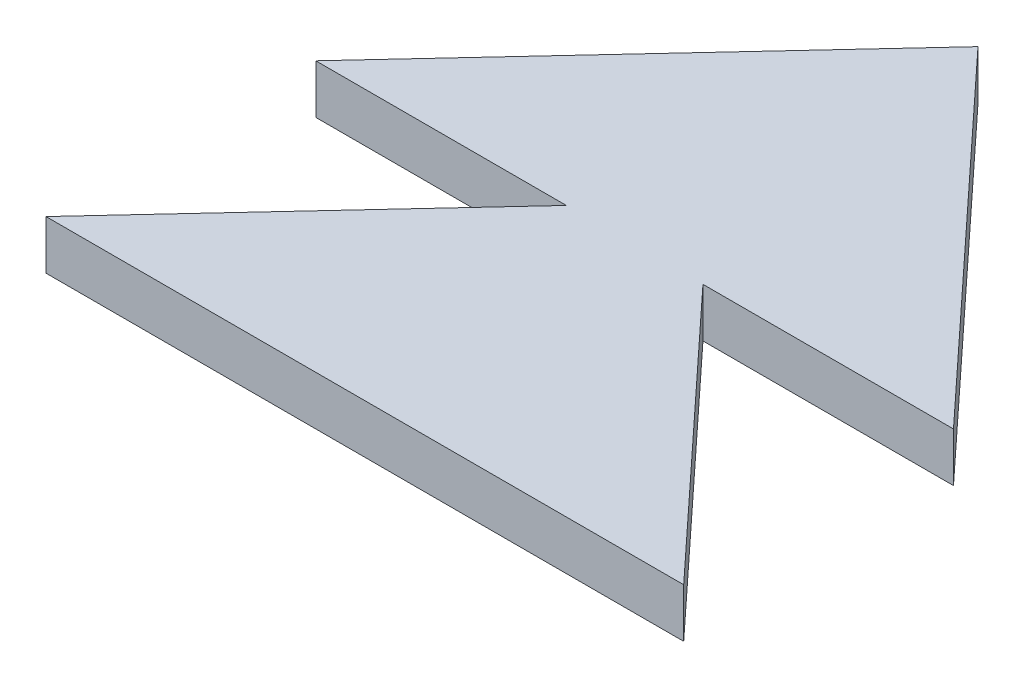
ISO-10303-21;
HEADER;
FILE_DESCRIPTION(('STEP AP214'),'2;1');
FILE_NAME('part.step','',(''),(''),'','','');
FILE_SCHEMA(('AUTOMOTIVE_DESIGN { 1 0 10303 214 1 1 1 1 }'));
ENDSEC;
DATA;
#1=APPLICATION_CONTEXT('core data for automotive mechanical design processes');
#2=APPLICATION_PROTOCOL_DEFINITION('international standard','automotive_design',2000,#1);
#3=PRODUCT_CONTEXT('',#1,'mechanical');
#4=PRODUCT('Part','Part','',(#3));
#5=PRODUCT_RELATED_PRODUCT_CATEGORY('part','',(#4));
#6=PRODUCT_DEFINITION_FORMATION('','',#4);
#7=PRODUCT_DEFINITION_CONTEXT('part definition',#1,'design');
#8=PRODUCT_DEFINITION('design','',#6,#7);
#9=PRODUCT_DEFINITION_SHAPE('','',#8);
#10=(LENGTH_UNIT() NAMED_UNIT(*) SI_UNIT(.MILLI.,.METRE.));
#11=(NAMED_UNIT(*) PLANE_ANGLE_UNIT() SI_UNIT($,.RADIAN.));
#12=(NAMED_UNIT(*) SI_UNIT($,.STERADIAN.) SOLID_ANGLE_UNIT());
#13=UNCERTAINTY_MEASURE_WITH_UNIT(LENGTH_MEASURE(1.E-05),#10,'distance_accuracy_value','');
#14=(GEOMETRIC_REPRESENTATION_CONTEXT(3) GLOBAL_UNCERTAINTY_ASSIGNED_CONTEXT((#13)) GLOBAL_UNIT_ASSIGNED_CONTEXT((#10,
#11,#12)) REPRESENTATION_CONTEXT('',''));
#15=CARTESIAN_POINT('',(0.,0.,0.));
#16=DIRECTION('',(0.,0.,1.));
#17=DIRECTION('',(1.,0.,0.));
#18=AXIS2_PLACEMENT_3D('',#15,#16,#17);
#19=CARTESIAN_POINT('',(5.10714285714286,1.,-5.5));
#20=DIRECTION('',(0.732793491626299,0.,0.680451099367278));
#21=DIRECTION('',(0.680451099367278,0.,-0.732793491626299));
#22=AXIS2_PLACEMENT_3D('',#19,#20,#21);
#23=PLANE('',#22);
#24=DIRECTION('',(-0.680451099367278,0.,0.732793491626299));
#25=VECTOR('',#24,1.);
#26=CARTESIAN_POINT('',(5.10714285714286,0.,-5.5));
#27=LINE('',#26,#25);
#28=CARTESIAN_POINT('',(5.10714285714286,0.,-5.5));
#29=VERTEX_POINT('',#28);
#30=CARTESIAN_POINT('',(0.,0.,0.));
#31=VERTEX_POINT('',#30);
#32=EDGE_CURVE('E129',#29,#31,#27,.T.);
#33=ORIENTED_EDGE('',*,*,#32,.T.);
#34=DIRECTION('',(0.,-1.,0.));
#35=VECTOR('',#34,1.);
#36=CARTESIAN_POINT('',(0.,1.,0.));
#37=LINE('',#36,#35);
#38=CARTESIAN_POINT('',(0.,1.,0.));
#39=VERTEX_POINT('',#38);
#40=EDGE_CURVE('E11',#39,#31,#37,.T.);
#41=ORIENTED_EDGE('',*,*,#40,.F.);
#42=DIRECTION('',(-0.680451099367278,0.,0.732793491626299));
#43=VECTOR('',#42,1.);
#44=CARTESIAN_POINT('',(5.10714285714286,1.,-5.5));
#45=LINE('',#44,#43);
#46=CARTESIAN_POINT('',(5.10714285714286,1.,-5.5));
#47=VERTEX_POINT('',#46);
#48=EDGE_CURVE('E141',#47,#39,#45,.T.);
#49=ORIENTED_EDGE('',*,*,#48,.F.);
#50=DIRECTION('',(0.,-1.,0.));
#51=VECTOR('',#50,1.);
#52=CARTESIAN_POINT('',(5.10714285714286,1.,-5.5));
#53=LINE('',#52,#51);
#54=EDGE_CURVE('E125',#47,#29,#53,.T.);
#55=ORIENTED_EDGE('',*,*,#54,.T.);
#56=EDGE_LOOP('',(#33,#41,#49,#55));
#57=FACE_BOUND('',#56,.T.);
#58=ADVANCED_FACE('F39',(#57),#23,.F.);
#59=CARTESIAN_POINT('',(0.,1.,0.));
#60=DIRECTION('',(0.,0.,-1.));
#61=DIRECTION('',(-1.,0.,0.));
#62=AXIS2_PLACEMENT_3D('',#59,#60,#61);
#63=PLANE('',#62);
#64=DIRECTION('',(1.,0.,0.));
#65=VECTOR('',#64,1.);
#66=CARTESIAN_POINT('',(0.,0.,0.));
#67=LINE('',#66,#65);
#68=CARTESIAN_POINT('',(13.,0.,0.));
#69=VERTEX_POINT('',#68);
#70=EDGE_CURVE('E132',#31,#69,#67,.T.);
#71=ORIENTED_EDGE('',*,*,#70,.T.);
#72=DIRECTION('',(0.,-1.,0.));
#73=VECTOR('',#72,1.);
#74=CARTESIAN_POINT('',(13.,1.,0.));
#75=LINE('',#74,#73);
#76=CARTESIAN_POINT('',(13.,1.,0.));
#77=VERTEX_POINT('',#76);
#78=EDGE_CURVE('E47',#77,#69,#75,.T.);
#79=ORIENTED_EDGE('',*,*,#78,.F.);
#80=DIRECTION('',(1.,0.,0.));
#81=VECTOR('',#80,1.);
#82=CARTESIAN_POINT('',(0.,1.,0.));
#83=LINE('',#82,#81);
#84=EDGE_CURVE('E95',#39,#77,#83,.T.);
#85=ORIENTED_EDGE('',*,*,#84,.F.);
#86=ORIENTED_EDGE('',*,*,#40,.T.);
#87=EDGE_LOOP('',(#71,#79,#85,#86));
#88=FACE_BOUND('',#87,.T.);
#89=ADVANCED_FACE('F166',(#88),#63,.F.);
#90=CARTESIAN_POINT('',(13.,1.,0.));
#91=DIRECTION('',(-0.732793491626299,0.,0.680451099367278));
#92=DIRECTION('',(0.680451099367278,0.,0.732793491626299));
#93=AXIS2_PLACEMENT_3D('',#90,#91,#92);
#94=PLANE('',#93);
#95=DIRECTION('',(-0.680451099367278,0.,-0.732793491626299));
#96=VECTOR('',#95,1.);
#97=CARTESIAN_POINT('',(13.,0.,0.));
#98=LINE('',#97,#96);
#99=CARTESIAN_POINT('',(7.89285714285714,0.,-5.5));
#100=VERTEX_POINT('',#99);
#101=EDGE_CURVE('E134',#69,#100,#98,.T.);
#102=ORIENTED_EDGE('',*,*,#101,.T.);
#103=DIRECTION('',(0.,-1.,0.));
#104=VECTOR('',#103,1.);
#105=CARTESIAN_POINT('',(7.89285714285714,1.,-5.5));
#106=LINE('',#105,#104);
#107=CARTESIAN_POINT('',(7.89285714285714,1.,-5.5));
#108=VERTEX_POINT('',#107);
#109=EDGE_CURVE('E145',#108,#100,#106,.T.);
#110=ORIENTED_EDGE('',*,*,#109,.F.);
#111=DIRECTION('',(-0.680451099367278,0.,-0.732793491626299));
#112=VECTOR('',#111,1.);
#113=CARTESIAN_POINT('',(13.,1.,0.));
#114=LINE('',#113,#112);
#115=EDGE_CURVE('E153',#77,#108,#114,.T.);
#116=ORIENTED_EDGE('',*,*,#115,.F.);
#117=ORIENTED_EDGE('',*,*,#78,.T.);
#118=EDGE_LOOP('',(#102,#110,#116,#117));
#119=FACE_BOUND('',#118,.T.);
#120=ADVANCED_FACE('F151',(#119),#94,.F.);
#121=CARTESIAN_POINT('',(7.89285714285714,1.,-5.5));
#122=DIRECTION('',(0.,0.,-1.));
#123=DIRECTION('',(-1.,0.,0.));
#124=AXIS2_PLACEMENT_3D('',#121,#122,#123);
#125=PLANE('',#124);
#126=DIRECTION('',(1.,0.,0.));
#127=VECTOR('',#126,1.);
#128=CARTESIAN_POINT('',(7.89285714285714,0.,-5.5));
#129=LINE('',#128,#127);
#130=CARTESIAN_POINT('',(13.,0.,-5.5));
#131=VERTEX_POINT('',#130);
#132=EDGE_CURVE('E136',#100,#131,#129,.T.);
#133=ORIENTED_EDGE('',*,*,#132,.T.);
#134=DIRECTION('',(0.,-1.,0.));
#135=VECTOR('',#134,1.);
#136=CARTESIAN_POINT('',(13.,1.,-5.5));
#137=LINE('',#136,#135);
#138=CARTESIAN_POINT('',(13.,1.,-5.5));
#139=VERTEX_POINT('',#138);
#140=EDGE_CURVE('E120',#139,#131,#137,.T.);
#141=ORIENTED_EDGE('',*,*,#140,.F.);
#142=DIRECTION('',(1.,0.,0.));
#143=VECTOR('',#142,1.);
#144=CARTESIAN_POINT('',(7.89285714285714,1.,-5.5));
#145=LINE('',#144,#143);
#146=EDGE_CURVE('E111',#108,#139,#145,.T.);
#147=ORIENTED_EDGE('',*,*,#146,.F.);
#148=ORIENTED_EDGE('',*,*,#109,.T.);
#149=EDGE_LOOP('',(#133,#141,#147,#148));
#150=FACE_BOUND('',#149,.T.);
#151=ADVANCED_FACE('F159',(#150),#125,.F.);
#152=CARTESIAN_POINT('',(13.,1.,-5.5));
#153=DIRECTION('',(-0.732793491626298,0.,0.680451099367279));
#154=DIRECTION('',(0.680451099367279,0.,0.732793491626298));
#155=AXIS2_PLACEMENT_3D('',#152,#153,#154);
#156=PLANE('',#155);
#157=DIRECTION('',(-0.680451099367279,0.,-0.732793491626298));
#158=VECTOR('',#157,1.);
#159=CARTESIAN_POINT('',(13.,0.,-5.5));
#160=LINE('',#159,#158);
#161=CARTESIAN_POINT('',(6.49999999999998,0.,-12.5));
#162=VERTEX_POINT('',#161);
#163=EDGE_CURVE('E119',#131,#162,#160,.T.);
#164=ORIENTED_EDGE('',*,*,#163,.T.);
#165=DIRECTION('',(0.,-1.,0.));
#166=VECTOR('',#165,1.);
#167=CARTESIAN_POINT('',(6.49999999999998,1.,-12.5));
#168=LINE('',#167,#166);
#169=CARTESIAN_POINT('',(6.49999999999998,1.,-12.5));
#170=VERTEX_POINT('',#169);
#171=EDGE_CURVE('E116',#170,#162,#168,.T.);
#172=ORIENTED_EDGE('',*,*,#171,.F.);
#173=DIRECTION('',(-0.680451099367279,0.,-0.732793491626298));
#174=VECTOR('',#173,1.);
#175=CARTESIAN_POINT('',(13.,1.,-5.5));
#176=LINE('',#175,#174);
#177=EDGE_CURVE('E105',#139,#170,#176,.T.);
#178=ORIENTED_EDGE('',*,*,#177,.F.);
#179=ORIENTED_EDGE('',*,*,#140,.T.);
#180=EDGE_LOOP('',(#164,#172,#178,#179));
#181=FACE_BOUND('',#180,.T.);
#182=ADVANCED_FACE('F117',(#181),#156,.F.);
#183=CARTESIAN_POINT('',(6.49999999999998,1.,-12.5));
#184=DIRECTION('',(0.7327934916263,0.,0.680451099367277));
#185=DIRECTION('',(0.680451099367277,0.,-0.7327934916263));
#186=AXIS2_PLACEMENT_3D('',#183,#184,#185);
#187=PLANE('',#186);
#188=DIRECTION('',(-0.680451099367277,0.,0.7327934916263));
#189=VECTOR('',#188,1.);
#190=CARTESIAN_POINT('',(6.49999999999998,0.,-12.5));
#191=LINE('',#190,#189);
#192=CARTESIAN_POINT('',(0.,0.,-5.5));
#193=VERTEX_POINT('',#192);
#194=EDGE_CURVE('E81',#162,#193,#191,.T.);
#195=ORIENTED_EDGE('',*,*,#194,.T.);
#196=DIRECTION('',(0.,-1.,0.));
#197=VECTOR('',#196,1.);
#198=CARTESIAN_POINT('',(0.,1.,-5.5));
#199=LINE('',#198,#197);
#200=CARTESIAN_POINT('',(0.,1.,-5.5));
#201=VERTEX_POINT('',#200);
#202=EDGE_CURVE('E121',#201,#193,#199,.T.);
#203=ORIENTED_EDGE('',*,*,#202,.F.);
#204=DIRECTION('',(-0.680451099367277,0.,0.7327934916263));
#205=VECTOR('',#204,1.);
#206=CARTESIAN_POINT('',(6.49999999999998,1.,-12.5));
#207=LINE('',#206,#205);
#208=EDGE_CURVE('E109',#170,#201,#207,.T.);
#209=ORIENTED_EDGE('',*,*,#208,.F.);
#210=ORIENTED_EDGE('',*,*,#171,.T.);
#211=EDGE_LOOP('',(#195,#203,#209,#210));
#212=FACE_BOUND('',#211,.T.);
#213=ADVANCED_FACE('F123',(#212),#187,.F.);
#214=CARTESIAN_POINT('',(0.,1.,-5.5));
#215=DIRECTION('',(0.,0.,-1.));
#216=DIRECTION('',(-1.,0.,0.));
#217=AXIS2_PLACEMENT_3D('',#214,#215,#216);
#218=PLANE('',#217);
#219=DIRECTION('',(1.,0.,0.));
#220=VECTOR('',#219,1.);
#221=CARTESIAN_POINT('',(0.,0.,-5.5));
#222=LINE('',#221,#220);
#223=EDGE_CURVE('E87',#193,#29,#222,.T.);
#224=ORIENTED_EDGE('',*,*,#223,.T.);
#225=ORIENTED_EDGE('',*,*,#54,.F.);
#226=DIRECTION('',(1.,0.,0.));
#227=VECTOR('',#226,1.);
#228=CARTESIAN_POINT('',(0.,1.,-5.5));
#229=LINE('',#228,#227);
#230=EDGE_CURVE('E55',#201,#47,#229,.T.);
#231=ORIENTED_EDGE('',*,*,#230,.F.);
#232=ORIENTED_EDGE('',*,*,#202,.T.);
#233=EDGE_LOOP('',(#224,#225,#231,#232));
#234=FACE_BOUND('',#233,.T.);
#235=ADVANCED_FACE('F180',(#234),#218,.F.);
#236=CARTESIAN_POINT('',(0.,1.,0.));
#237=DIRECTION('',(0.,-1.,0.));
#238=DIRECTION('',(0.,0.,-1.));
#239=AXIS2_PLACEMENT_3D('',#236,#237,#238);
#240=PLANE('',#239);
#241=ORIENTED_EDGE('',*,*,#48,.T.);
#242=ORIENTED_EDGE('',*,*,#84,.T.);
#243=ORIENTED_EDGE('',*,*,#115,.T.);
#244=ORIENTED_EDGE('',*,*,#146,.T.);
#245=ORIENTED_EDGE('',*,*,#177,.T.);
#246=ORIENTED_EDGE('',*,*,#208,.T.);
#247=ORIENTED_EDGE('',*,*,#230,.T.);
#248=EDGE_LOOP('',(#241,#242,#243,#244,#245,#246,#247));
#249=FACE_BOUND('',#248,.T.);
#250=ADVANCED_FACE('F107',(#249),#240,.F.);
#251=CARTESIAN_POINT('',(0.,0.,0.));
#252=DIRECTION('',(0.,-1.,0.));
#253=DIRECTION('',(0.,0.,-1.));
#254=AXIS2_PLACEMENT_3D('',#251,#252,#253);
#255=PLANE('',#254);
#256=ORIENTED_EDGE('',*,*,#32,.F.);
#257=ORIENTED_EDGE('',*,*,#223,.F.);
#258=ORIENTED_EDGE('',*,*,#194,.F.);
#259=ORIENTED_EDGE('',*,*,#163,.F.);
#260=ORIENTED_EDGE('',*,*,#132,.F.);
#261=ORIENTED_EDGE('',*,*,#101,.F.);
#262=ORIENTED_EDGE('',*,*,#70,.F.);
#263=EDGE_LOOP('',(#256,#257,#258,#259,#260,#261,#262));
#264=FACE_BOUND('',#263,.T.);
#265=ADVANCED_FACE('F157',(#264),#255,.T.);
#266=CLOSED_SHELL('',(#58,#89,#120,#151,#182,#213,#235,#250,#265));
#267=MANIFOLD_SOLID_BREP('B2',#266);
#268=ADVANCED_BREP_SHAPE_REPRESENTATION('',(#18,#267),#14);
#269=SHAPE_DEFINITION_REPRESENTATION(#9,#268);
ENDSEC;
END-ISO-10303-21;
